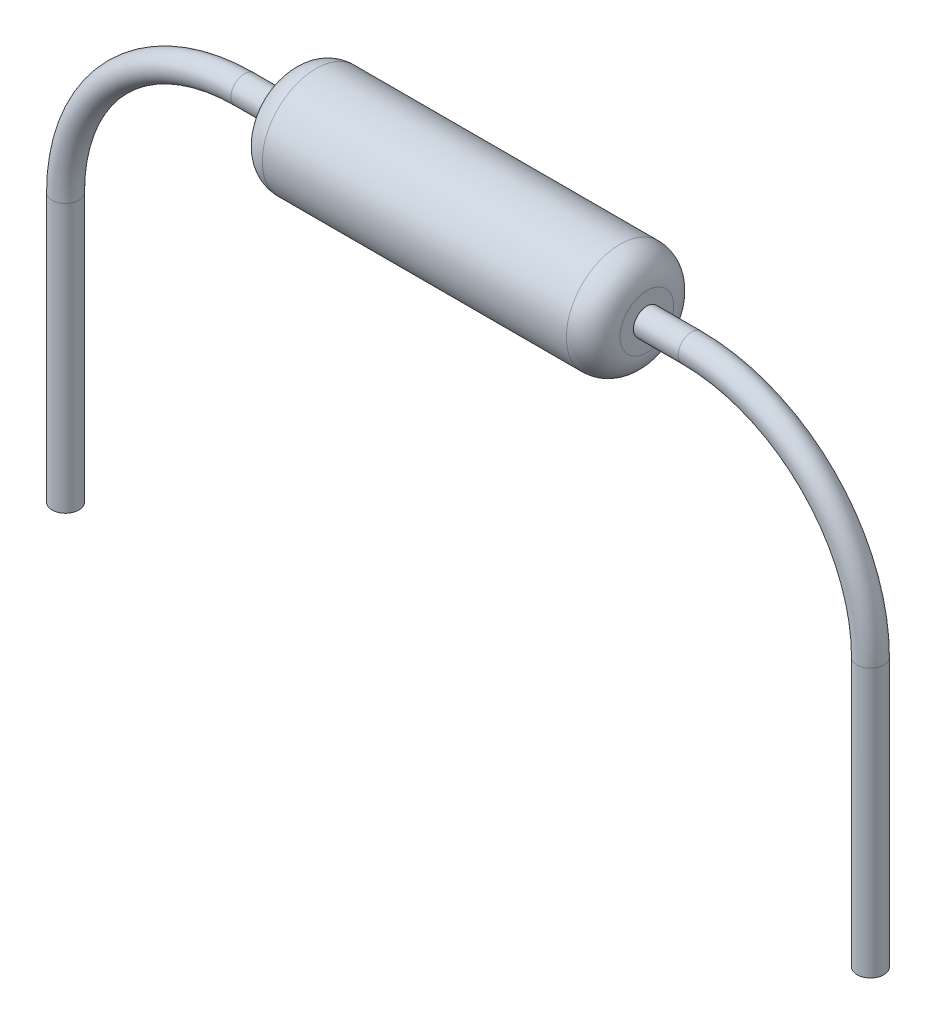
ISO-10303-21;
HEADER;
FILE_DESCRIPTION(('STEP AP214'),'2;1');
FILE_NAME('part.step','',(''),(''),'','','');
FILE_SCHEMA(('AUTOMOTIVE_DESIGN { 1 0 10303 214 1 1 1 1 }'));
ENDSEC;
DATA;
#1=APPLICATION_CONTEXT('core data for automotive mechanical design processes');
#2=APPLICATION_PROTOCOL_DEFINITION('international standard','automotive_design',2000,#1);
#3=PRODUCT_CONTEXT('',#1,'mechanical');
#4=PRODUCT('Part','Part','',(#3));
#5=PRODUCT_RELATED_PRODUCT_CATEGORY('part','',(#4));
#6=PRODUCT_DEFINITION_FORMATION('','',#4);
#7=PRODUCT_DEFINITION_CONTEXT('part definition',#1,'design');
#8=PRODUCT_DEFINITION('design','',#6,#7);
#9=PRODUCT_DEFINITION_SHAPE('','',#8);
#10=(LENGTH_UNIT() NAMED_UNIT(*) SI_UNIT(.MILLI.,.METRE.));
#11=(NAMED_UNIT(*) PLANE_ANGLE_UNIT() SI_UNIT($,.RADIAN.));
#12=(NAMED_UNIT(*) SI_UNIT($,.STERADIAN.) SOLID_ANGLE_UNIT());
#13=UNCERTAINTY_MEASURE_WITH_UNIT(LENGTH_MEASURE(1.E-05),#10,'distance_accuracy_value','');
#14=(GEOMETRIC_REPRESENTATION_CONTEXT(3) GLOBAL_UNCERTAINTY_ASSIGNED_CONTEXT((#13)) GLOBAL_UNIT_ASSIGNED_CONTEXT((#10,
#11,#12)) REPRESENTATION_CONTEXT('',''));
#15=CARTESIAN_POINT('',(0.,0.,0.));
#16=DIRECTION('',(0.,0.,1.));
#17=DIRECTION('',(1.,0.,0.));
#18=AXIS2_PLACEMENT_3D('',#15,#16,#17);
#19=CARTESIAN_POINT('',(-2.,0.3,0.));
#20=DIRECTION('',(-1.,0.,0.));
#21=DIRECTION('',(0.,-1.,0.));
#22=AXIS2_PLACEMENT_3D('',#19,#20,#21);
#23=PLANE('',#22);
#24=CARTESIAN_POINT('',(-2.,0.,0.));
#25=DIRECTION('',(1.,0.,0.));
#26=DIRECTION('',(0.,1.,0.));
#27=AXIS2_PLACEMENT_3D('',#24,#25,#26);
#28=CIRCLE('',#27,0.3);
#29=CARTESIAN_POINT('',(-2.,0.3,0.));
#30=VERTEX_POINT('',#29);
#31=EDGE_CURVE('E117',#30,#30,#28,.T.);
#32=ORIENTED_EDGE('',*,*,#31,.F.);
#33=EDGE_LOOP('',(#32));
#34=FACE_BOUND('',#33,.T.);
#35=CARTESIAN_POINT('',(-2.,0.,0.));
#36=DIRECTION('',(-1.,0.,0.));
#37=DIRECTION('',(0.,-1.,0.));
#38=AXIS2_PLACEMENT_3D('',#35,#36,#37);
#39=CIRCLE('',#38,0.15);
#40=CARTESIAN_POINT('',(-2.,-0.15,0.));
#41=VERTEX_POINT('',#40);
#42=EDGE_CURVE('E34',#41,#41,#39,.T.);
#43=ORIENTED_EDGE('',*,*,#42,.F.);
#44=EDGE_LOOP('',(#43));
#45=FACE_BOUND('',#44,.T.);
#46=ADVANCED_FACE('F30',(#34,#45),#23,.T.);
#47=CARTESIAN_POINT('',(2.,0.3,0.));
#48=DIRECTION('',(1.,0.,0.));
#49=DIRECTION('',(0.,1.,0.));
#50=AXIS2_PLACEMENT_3D('',#47,#48,#49);
#51=PLANE('',#50);
#52=CARTESIAN_POINT('',(2.,0.,0.));
#53=DIRECTION('',(1.,0.,0.));
#54=DIRECTION('',(0.,1.,0.));
#55=AXIS2_PLACEMENT_3D('',#52,#53,#54);
#56=CIRCLE('',#55,0.3);
#57=CARTESIAN_POINT('',(2.,0.3,0.));
#58=VERTEX_POINT('',#57);
#59=EDGE_CURVE('E134',#58,#58,#56,.T.);
#60=ORIENTED_EDGE('',*,*,#59,.T.);
#61=EDGE_LOOP('',(#60));
#62=FACE_BOUND('',#61,.T.);
#63=CARTESIAN_POINT('',(2.,0.,0.));
#64=DIRECTION('',(1.,0.,0.));
#65=DIRECTION('',(0.,1.,0.));
#66=AXIS2_PLACEMENT_3D('',#63,#64,#65);
#67=CIRCLE('',#66,0.15);
#68=CARTESIAN_POINT('',(2.,0.15,0.));
#69=VERTEX_POINT('',#68);
#70=EDGE_CURVE('E76',#69,#69,#67,.T.);
#71=ORIENTED_EDGE('',*,*,#70,.F.);
#72=EDGE_LOOP('',(#71));
#73=FACE_BOUND('',#72,.T.);
#74=ADVANCED_FACE('F148',(#62,#73),#51,.T.);
#75=CARTESIAN_POINT('',(-1.7,0.,0.));
#76=DIRECTION('',(1.,0.,0.));
#77=DIRECTION('',(0.,1.,0.));
#78=AXIS2_PLACEMENT_3D('',#75,#76,#77);
#79=TOROIDAL_SURFACE('',#78,0.3,0.3);
#80=ORIENTED_EDGE('',*,*,#31,.T.);
#81=EDGE_LOOP('',(#80));
#82=FACE_BOUND('',#81,.T.);
#83=CARTESIAN_POINT('',(-1.7,0.,0.));
#84=DIRECTION('',(1.,0.,0.));
#85=DIRECTION('',(0.,1.,0.));
#86=AXIS2_PLACEMENT_3D('',#83,#84,#85);
#87=CIRCLE('',#86,0.6);
#88=CARTESIAN_POINT('',(-1.7,0.6,0.));
#89=VERTEX_POINT('',#88);
#90=EDGE_CURVE('E77',#89,#89,#87,.T.);
#91=ORIENTED_EDGE('',*,*,#90,.F.);
#92=EDGE_LOOP('',(#91));
#93=FACE_BOUND('',#92,.T.);
#94=ADVANCED_FACE('F146',(#82,#93),#79,.T.);
#95=CARTESIAN_POINT('',(2.,0.,0.));
#96=DIRECTION('',(1.,0.,0.));
#97=DIRECTION('',(0.,1.,0.));
#98=AXIS2_PLACEMENT_3D('',#95,#96,#97);
#99=CYLINDRICAL_SURFACE('',#98,0.6);
#100=ORIENTED_EDGE('',*,*,#90,.T.);
#101=EDGE_LOOP('',(#100));
#102=FACE_BOUND('',#101,.T.);
#103=CARTESIAN_POINT('',(1.7,0.,0.));
#104=DIRECTION('',(1.,0.,0.));
#105=DIRECTION('',(0.,1.,0.));
#106=AXIS2_PLACEMENT_3D('',#103,#104,#105);
#107=CIRCLE('',#106,0.6);
#108=CARTESIAN_POINT('',(1.7,0.6,0.));
#109=VERTEX_POINT('',#108);
#110=EDGE_CURVE('E136',#109,#109,#107,.T.);
#111=ORIENTED_EDGE('',*,*,#110,.F.);
#112=EDGE_LOOP('',(#111));
#113=FACE_BOUND('',#112,.T.);
#114=ADVANCED_FACE('F143',(#102,#113),#99,.T.);
#115=CARTESIAN_POINT('',(1.7,0.,0.));
#116=DIRECTION('',(1.,0.,0.));
#117=DIRECTION('',(0.,1.,0.));
#118=AXIS2_PLACEMENT_3D('',#115,#116,#117);
#119=DEGENERATE_TOROIDAL_SURFACE('',#118,0.3,0.3,.T.);
#120=ORIENTED_EDGE('',*,*,#110,.T.);
#121=EDGE_LOOP('',(#120));
#122=FACE_BOUND('',#121,.T.);
#123=ORIENTED_EDGE('',*,*,#59,.F.);
#124=EDGE_LOOP('',(#123));
#125=FACE_BOUND('',#124,.T.);
#126=ADVANCED_FACE('F155',(#122,#125),#119,.T.);
#127=CARTESIAN_POINT('',(-4.5,-5.,0.));
#128=DIRECTION('',(0.,1.,0.));
#129=DIRECTION('',(0.,0.,1.));
#130=AXIS2_PLACEMENT_3D('',#127,#128,#129);
#131=CYLINDRICAL_SURFACE('',#130,0.15);
#132=CARTESIAN_POINT('',(-4.5,-5.,0.));
#133=DIRECTION('',(0.,1.,0.));
#134=DIRECTION('',(0.,0.,1.));
#135=AXIS2_PLACEMENT_3D('',#132,#133,#134);
#136=CIRCLE('',#135,0.15);
#137=CARTESIAN_POINT('',(-4.5,-5.,0.15));
#138=VERTEX_POINT('',#137);
#139=EDGE_CURVE('E114',#138,#138,#136,.T.);
#140=ORIENTED_EDGE('',*,*,#139,.T.);
#141=EDGE_LOOP('',(#140));
#142=FACE_BOUND('',#141,.T.);
#143=CARTESIAN_POINT('',(-4.5,-2.,0.));
#144=DIRECTION('',(0.,-1.,0.));
#145=DIRECTION('',(0.,0.,-1.));
#146=AXIS2_PLACEMENT_3D('',#143,#144,#145);
#147=CIRCLE('',#146,0.15);
#148=CARTESIAN_POINT('',(-4.65,-2.,0.));
#149=VERTEX_POINT('',#148);
#150=EDGE_CURVE('E84',#149,#149,#147,.T.);
#151=ORIENTED_EDGE('',*,*,#150,.T.);
#152=EDGE_LOOP('',(#151));
#153=FACE_BOUND('',#152,.T.);
#154=ADVANCED_FACE('F193',(#142,#153),#131,.T.);
#155=CARTESIAN_POINT('',(-2.5,-2.,0.));
#156=DIRECTION('',(0.,0.,-1.));
#157=DIRECTION('',(-1.,0.,0.));
#158=AXIS2_PLACEMENT_3D('',#155,#156,#157);
#159=TOROIDAL_SURFACE('',#158,2.,0.15);
#160=CARTESIAN_POINT('',(-2.5,0.,0.));
#161=DIRECTION('',(-1.,0.,0.));
#162=DIRECTION('',(0.,0.,-1.));
#163=AXIS2_PLACEMENT_3D('',#160,#161,#162);
#164=CIRCLE('',#163,0.15);
#165=CARTESIAN_POINT('',(-2.5,0.15,0.));
#166=VERTEX_POINT('',#165);
#167=EDGE_CURVE('E88',#166,#166,#164,.T.);
#168=CARTESIAN_POINT('',(-2.5,-2.,0.));
#169=DIRECTION('',(0.,0.,-1.));
#170=DIRECTION('',(-1.,0.,0.));
#171=AXIS2_PLACEMENT_3D('',#168,#169,#170);
#172=CIRCLE('',#171,2.15);
#173=EDGE_CURVE('',#149,#166,#172,.T.);
#174=ORIENTED_EDGE('',*,*,#150,.F.);
#175=ORIENTED_EDGE('',*,*,#167,.T.);
#176=ORIENTED_EDGE('',*,*,#173,.T.);
#177=ORIENTED_EDGE('',*,*,#173,.F.);
#178=EDGE_LOOP('',(#174,#176,#175,#177));
#179=FACE_BOUND('',#178,.T.);
#180=ADVANCED_FACE('F197',(#179),#159,.T.);
#181=CARTESIAN_POINT('',(-2.5,0.,0.));
#182=DIRECTION('',(1.,0.,0.));
#183=DIRECTION('',(0.,1.,0.));
#184=AXIS2_PLACEMENT_3D('',#181,#182,#183);
#185=CYLINDRICAL_SURFACE('',#184,0.15);
#186=ORIENTED_EDGE('',*,*,#42,.T.);
#187=EDGE_LOOP('',(#186));
#188=FACE_BOUND('',#187,.T.);
#189=ORIENTED_EDGE('',*,*,#167,.F.);
#190=EDGE_LOOP('',(#189));
#191=FACE_BOUND('',#190,.T.);
#192=ADVANCED_FACE('F108',(#188,#191),#185,.T.);
#193=CARTESIAN_POINT('',(4.5,-2.,0.));
#194=DIRECTION('',(0.,-1.,0.));
#195=DIRECTION('',(1.,0.,0.));
#196=AXIS2_PLACEMENT_3D('',#193,#194,#195);
#197=CYLINDRICAL_SURFACE('',#196,0.15);
#198=CARTESIAN_POINT('',(4.5,-2.,0.));
#199=DIRECTION('',(0.,1.,0.));
#200=DIRECTION('',(0.,0.,-1.));
#201=AXIS2_PLACEMENT_3D('',#198,#199,#200);
#202=CIRCLE('',#201,0.15);
#203=CARTESIAN_POINT('',(4.65,-2.,0.));
#204=VERTEX_POINT('',#203);
#205=EDGE_CURVE('E48',#204,#204,#202,.T.);
#206=ORIENTED_EDGE('',*,*,#205,.F.);
#207=EDGE_LOOP('',(#206));
#208=FACE_BOUND('',#207,.T.);
#209=CARTESIAN_POINT('',(4.5,-5.,0.));
#210=DIRECTION('',(0.,1.,0.));
#211=DIRECTION('',(0.,0.,1.));
#212=AXIS2_PLACEMENT_3D('',#209,#210,#211);
#213=CIRCLE('',#212,0.15);
#214=CARTESIAN_POINT('',(4.5,-5.,0.15));
#215=VERTEX_POINT('',#214);
#216=EDGE_CURVE('E112',#215,#215,#213,.T.);
#217=ORIENTED_EDGE('',*,*,#216,.T.);
#218=EDGE_LOOP('',(#217));
#219=FACE_BOUND('',#218,.T.);
#220=ADVANCED_FACE('F105',(#208,#219),#197,.T.);
#221=CARTESIAN_POINT('',(2.5,-2.,0.));
#222=DIRECTION('',(0.,0.,-1.));
#223=DIRECTION('',(-1.,0.,0.));
#224=AXIS2_PLACEMENT_3D('',#221,#222,#223);
#225=TOROIDAL_SURFACE('',#224,2.,0.15);
#226=CARTESIAN_POINT('',(2.5,0.,0.));
#227=DIRECTION('',(-1.,0.,0.));
#228=DIRECTION('',(0.,0.,-1.));
#229=AXIS2_PLACEMENT_3D('',#226,#227,#228);
#230=CIRCLE('',#229,0.15);
#231=CARTESIAN_POINT('',(2.5,0.15,0.));
#232=VERTEX_POINT('',#231);
#233=EDGE_CURVE('E93',#232,#232,#230,.T.);
#234=CARTESIAN_POINT('',(2.5,-2.,0.));
#235=DIRECTION('',(0.,0.,-1.));
#236=DIRECTION('',(-1.,0.,0.));
#237=AXIS2_PLACEMENT_3D('',#234,#235,#236);
#238=CIRCLE('',#237,2.15);
#239=EDGE_CURVE('',#232,#204,#238,.T.);
#240=ORIENTED_EDGE('',*,*,#233,.F.);
#241=ORIENTED_EDGE('',*,*,#205,.T.);
#242=ORIENTED_EDGE('',*,*,#239,.T.);
#243=ORIENTED_EDGE('',*,*,#239,.F.);
#244=EDGE_LOOP('',(#240,#242,#241,#243));
#245=FACE_BOUND('',#244,.T.);
#246=ADVANCED_FACE('F103',(#245),#225,.T.);
#247=ORIENTED_EDGE('',*,*,#70,.T.);
#248=EDGE_LOOP('',(#247));
#249=FACE_BOUND('',#248,.T.);
#250=ORIENTED_EDGE('',*,*,#233,.T.);
#251=EDGE_LOOP('',(#250));
#252=FACE_BOUND('',#251,.T.);
#253=ADVANCED_FACE('F204',(#249,#252),#185,.T.);
#254=CARTESIAN_POINT('',(-5.,-5.,-0.6));
#255=DIRECTION('',(0.,1.,0.));
#256=DIRECTION('',(0.,0.,1.));
#257=AXIS2_PLACEMENT_3D('',#254,#255,#256);
#258=PLANE('',#257);
#259=ORIENTED_EDGE('',*,*,#216,.F.);
#260=EDGE_LOOP('',(#259));
#261=FACE_BOUND('',#260,.T.);
#262=ADVANCED_FACE('F206',(#261),#258,.F.);
#263=ORIENTED_EDGE('',*,*,#139,.F.);
#264=EDGE_LOOP('',(#263));
#265=FACE_BOUND('',#264,.T.);
#266=ADVANCED_FACE('F169',(#265),#258,.F.);
#267=CLOSED_SHELL('',(#46,#74,#94,#114,#126,#154,#180,#192,#220,#246,#253,#262,#266));
#268=CARTESIAN_POINT('',(-1.75,0.35,0.));
#269=DIRECTION('',(1.,0.,0.));
#270=DIRECTION('',(0.,0.,-1.));
#271=AXIS2_PLACEMENT_3D('',#268,#269,#270);
#272=PLANE('',#271);
#273=CARTESIAN_POINT('',(-1.75,0.,0.));
#274=DIRECTION('',(1.,0.,0.));
#275=DIRECTION('',(0.,0.,-1.));
#276=AXIS2_PLACEMENT_3D('',#273,#274,#275);
#277=CIRCLE('',#276,0.25);
#278=CARTESIAN_POINT('',(-1.75,0.,-0.25));
#279=VERTEX_POINT('',#278);
#280=EDGE_CURVE('E56',#279,#279,#277,.F.);
#281=ORIENTED_EDGE('',*,*,#280,.T.);
#282=EDGE_LOOP('',(#281));
#283=FACE_BOUND('',#282,.T.);
#284=CARTESIAN_POINT('',(-1.75,0.,0.));
#285=DIRECTION('',(1.,0.,0.));
#286=DIRECTION('',(0.,0.,-1.));
#287=AXIS2_PLACEMENT_3D('',#284,#285,#286);
#288=CIRCLE('',#287,0.15);
#289=CARTESIAN_POINT('',(-1.75,0.,-0.15));
#290=VERTEX_POINT('',#289);
#291=EDGE_CURVE('E10',#290,#290,#288,.F.);
#292=ORIENTED_EDGE('',*,*,#291,.F.);
#293=EDGE_LOOP('',(#292));
#294=FACE_BOUND('',#293,.T.);
#295=ADVANCED_FACE('F232',(#283,#294),#272,.F.);
#296=CARTESIAN_POINT('',(1.75,0.35,0.));
#297=DIRECTION('',(-1.,0.,0.));
#298=DIRECTION('',(0.,0.,1.));
#299=AXIS2_PLACEMENT_3D('',#296,#297,#298);
#300=PLANE('',#299);
#301=CARTESIAN_POINT('',(1.75,0.,0.));
#302=DIRECTION('',(-1.,0.,0.));
#303=DIRECTION('',(0.,0.,1.));
#304=AXIS2_PLACEMENT_3D('',#301,#302,#303);
#305=CIRCLE('',#304,0.25);
#306=CARTESIAN_POINT('',(1.75,0.,0.25));
#307=VERTEX_POINT('',#306);
#308=EDGE_CURVE('E65',#307,#307,#305,.F.);
#309=ORIENTED_EDGE('',*,*,#308,.T.);
#310=EDGE_LOOP('',(#309));
#311=FACE_BOUND('',#310,.T.);
#312=CARTESIAN_POINT('',(1.75,0.,0.));
#313=DIRECTION('',(-1.,0.,0.));
#314=DIRECTION('',(0.,0.,1.));
#315=AXIS2_PLACEMENT_3D('',#312,#313,#314);
#316=CIRCLE('',#315,0.15);
#317=CARTESIAN_POINT('',(1.75,0.,0.15));
#318=VERTEX_POINT('',#317);
#319=EDGE_CURVE('E39',#318,#318,#316,.F.);
#320=ORIENTED_EDGE('',*,*,#319,.F.);
#321=EDGE_LOOP('',(#320));
#322=FACE_BOUND('',#321,.T.);
#323=ADVANCED_FACE('F234',(#311,#322),#300,.F.);
#324=CARTESIAN_POINT('',(-19.9518482490272,0.,0.));
#325=DIRECTION('',(-1.,0.,0.));
#326=DIRECTION('',(0.,0.,1.));
#327=AXIS2_PLACEMENT_3D('',#324,#325,#326);
#328=CYLINDRICAL_SURFACE('',#327,0.35);
#329=CARTESIAN_POINT('',(-1.65,0.,0.));
#330=DIRECTION('',(1.,0.,0.));
#331=DIRECTION('',(0.,0.,-1.));
#332=AXIS2_PLACEMENT_3D('',#329,#330,#331);
#333=CIRCLE('',#332,0.35);
#334=CARTESIAN_POINT('',(-1.65,0.,-0.35));
#335=VERTEX_POINT('',#334);
#336=EDGE_CURVE('E62',#335,#335,#333,.T.);
#337=ORIENTED_EDGE('',*,*,#336,.T.);
#338=EDGE_LOOP('',(#337));
#339=FACE_BOUND('',#338,.T.);
#340=CARTESIAN_POINT('',(0.150000000000001,0.,0.));
#341=DIRECTION('',(1.,0.,0.));
#342=DIRECTION('',(0.,0.,-1.));
#343=AXIS2_PLACEMENT_3D('',#340,#341,#342);
#344=CIRCLE('',#343,0.35);
#345=CARTESIAN_POINT('',(0.150000000000001,0.,-0.35));
#346=VERTEX_POINT('',#345);
#347=EDGE_CURVE('E44',#346,#346,#344,.T.);
#348=ORIENTED_EDGE('',*,*,#347,.F.);
#349=EDGE_LOOP('',(#348));
#350=FACE_BOUND('',#349,.T.);
#351=ADVANCED_FACE('F231',(#339,#350),#328,.T.);
#352=CARTESIAN_POINT('',(-1.65,0.,0.));
#353=DIRECTION('',(1.,0.,0.));
#354=DIRECTION('',(0.,0.,-1.));
#355=AXIS2_PLACEMENT_3D('',#352,#353,#354);
#356=TOROIDAL_SURFACE('',#355,0.25,0.1);
#357=ORIENTED_EDGE('',*,*,#336,.F.);
#358=EDGE_LOOP('',(#357));
#359=FACE_BOUND('',#358,.T.);
#360=ORIENTED_EDGE('',*,*,#280,.F.);
#361=EDGE_LOOP('',(#360));
#362=FACE_BOUND('',#361,.T.);
#363=ADVANCED_FACE('F244',(#359,#362),#356,.T.);
#364=CARTESIAN_POINT('',(0.150000000000001,0.,0.));
#365=DIRECTION('',(1.,0.,0.));
#366=DIRECTION('',(0.,0.,-1.));
#367=AXIS2_PLACEMENT_3D('',#364,#365,#366);
#368=PLANE('',#367);
#369=CARTESIAN_POINT('',(0.15,0.,0.));
#370=DIRECTION('',(-1.,0.,0.));
#371=DIRECTION('',(0.,0.,1.));
#372=AXIS2_PLACEMENT_3D('',#369,#370,#371);
#373=CIRCLE('',#372,0.55);
#374=CARTESIAN_POINT('',(0.15,0.,0.55));
#375=VERTEX_POINT('',#374);
#376=EDGE_CURVE('E53',#375,#375,#373,.T.);
#377=ORIENTED_EDGE('',*,*,#376,.T.);
#378=EDGE_LOOP('',(#377));
#379=FACE_BOUND('',#378,.T.);
#380=ORIENTED_EDGE('',*,*,#347,.T.);
#381=EDGE_LOOP('',(#380));
#382=FACE_BOUND('',#381,.T.);
#383=ADVANCED_FACE('F246',(#379,#382),#368,.F.);
#384=CARTESIAN_POINT('',(1.25,0.55,0.));
#385=DIRECTION('',(-1.,0.,0.));
#386=DIRECTION('',(0.,0.,1.));
#387=AXIS2_PLACEMENT_3D('',#384,#385,#386);
#388=PLANE('',#387);
#389=CARTESIAN_POINT('',(1.25,0.,0.));
#390=DIRECTION('',(-1.,0.,0.));
#391=DIRECTION('',(0.,0.,1.));
#392=AXIS2_PLACEMENT_3D('',#389,#390,#391);
#393=CIRCLE('',#392,0.55);
#394=CARTESIAN_POINT('',(1.25,0.,0.55));
#395=VERTEX_POINT('',#394);
#396=EDGE_CURVE('E50',#395,#395,#393,.T.);
#397=ORIENTED_EDGE('',*,*,#396,.F.);
#398=EDGE_LOOP('',(#397));
#399=FACE_BOUND('',#398,.T.);
#400=CARTESIAN_POINT('',(1.25,0.,0.));
#401=DIRECTION('',(-1.,0.,0.));
#402=DIRECTION('',(0.,0.,1.));
#403=AXIS2_PLACEMENT_3D('',#400,#401,#402);
#404=CIRCLE('',#403,0.35);
#405=CARTESIAN_POINT('',(1.25,0.,0.35));
#406=VERTEX_POINT('',#405);
#407=EDGE_CURVE('E68',#406,#406,#404,.T.);
#408=ORIENTED_EDGE('',*,*,#407,.T.);
#409=EDGE_LOOP('',(#408));
#410=FACE_BOUND('',#409,.T.);
#411=ADVANCED_FACE('F252',(#399,#410),#388,.F.);
#412=CARTESIAN_POINT('',(0.,0.,0.));
#413=DIRECTION('',(-1.,0.,0.));
#414=DIRECTION('',(0.,0.,1.));
#415=AXIS2_PLACEMENT_3D('',#412,#413,#414);
#416=CYLINDRICAL_SURFACE('',#415,0.55);
#417=ORIENTED_EDGE('',*,*,#376,.F.);
#418=EDGE_LOOP('',(#417));
#419=FACE_BOUND('',#418,.T.);
#420=ORIENTED_EDGE('',*,*,#396,.T.);
#421=EDGE_LOOP('',(#420));
#422=FACE_BOUND('',#421,.T.);
#423=ADVANCED_FACE('F398',(#419,#422),#416,.T.);
#424=CARTESIAN_POINT('',(1.65,0.,0.));
#425=DIRECTION('',(-1.,0.,0.));
#426=DIRECTION('',(0.,0.,1.));
#427=AXIS2_PLACEMENT_3D('',#424,#425,#426);
#428=TOROIDAL_SURFACE('',#427,0.25,0.1);
#429=ORIENTED_EDGE('',*,*,#308,.F.);
#430=EDGE_LOOP('',(#429));
#431=FACE_BOUND('',#430,.T.);
#432=CARTESIAN_POINT('',(1.65,0.,0.));
#433=DIRECTION('',(-1.,0.,0.));
#434=DIRECTION('',(0.,0.,1.));
#435=AXIS2_PLACEMENT_3D('',#432,#433,#434);
#436=CIRCLE('',#435,0.35);
#437=CARTESIAN_POINT('',(1.65,0.,0.35));
#438=VERTEX_POINT('',#437);
#439=EDGE_CURVE('E59',#438,#438,#436,.T.);
#440=ORIENTED_EDGE('',*,*,#439,.F.);
#441=EDGE_LOOP('',(#440));
#442=FACE_BOUND('',#441,.T.);
#443=ADVANCED_FACE('F32',(#431,#442),#428,.T.);
#444=ORIENTED_EDGE('',*,*,#439,.T.);
#445=EDGE_LOOP('',(#444));
#446=FACE_BOUND('',#445,.T.);
#447=ORIENTED_EDGE('',*,*,#407,.F.);
#448=EDGE_LOOP('',(#447));
#449=FACE_BOUND('',#448,.T.);
#450=ADVANCED_FACE('F225',(#446,#449),#328,.T.);
#451=CARTESIAN_POINT('',(-1.955,0.,0.));
#452=DIRECTION('',(1.,0.,0.));
#453=DIRECTION('',(0.,1.,0.));
#454=AXIS2_PLACEMENT_3D('',#451,#452,#453);
#455=CIRCLE('',#454,0.15);
#456=CARTESIAN_POINT('',(-1.955,0.15,0.));
#457=VERTEX_POINT('',#456);
#458=EDGE_CURVE('E79',#457,#457,#455,.T.);
#459=ORIENTED_EDGE('',*,*,#458,.T.);
#460=EDGE_LOOP('',(#459));
#461=FACE_BOUND('',#460,.T.);
#462=ORIENTED_EDGE('',*,*,#291,.T.);
#463=EDGE_LOOP('',(#462));
#464=FACE_BOUND('',#463,.T.);
#465=ADVANCED_FACE('F214',(#461,#464),#185,.T.);
#466=CARTESIAN_POINT('',(1.955,0.,0.));
#467=DIRECTION('',(-1.,0.,0.));
#468=DIRECTION('',(0.,-1.,0.));
#469=AXIS2_PLACEMENT_3D('',#466,#467,#468);
#470=CIRCLE('',#469,0.15);
#471=CARTESIAN_POINT('',(1.955,-0.15,0.));
#472=VERTEX_POINT('',#471);
#473=EDGE_CURVE('E73',#472,#472,#470,.T.);
#474=ORIENTED_EDGE('',*,*,#473,.T.);
#475=EDGE_LOOP('',(#474));
#476=FACE_BOUND('',#475,.T.);
#477=ORIENTED_EDGE('',*,*,#319,.T.);
#478=EDGE_LOOP('',(#477));
#479=FACE_BOUND('',#478,.T.);
#480=ADVANCED_FACE('F174',(#476,#479),#185,.T.);
#481=CARTESIAN_POINT('',(-1.955,0.3,0.));
#482=DIRECTION('',(1.,0.,0.));
#483=DIRECTION('',(0.,1.,0.));
#484=AXIS2_PLACEMENT_3D('',#481,#482,#483);
#485=PLANE('',#484);
#486=CARTESIAN_POINT('',(-1.955,0.,0.));
#487=DIRECTION('',(1.,0.,0.));
#488=DIRECTION('',(0.,1.,0.));
#489=AXIS2_PLACEMENT_3D('',#486,#487,#488);
#490=CIRCLE('',#489,0.3);
#491=CARTESIAN_POINT('',(-1.955,0.3,0.));
#492=VERTEX_POINT('',#491);
#493=EDGE_CURVE('E122',#492,#492,#490,.T.);
#494=ORIENTED_EDGE('',*,*,#493,.T.);
#495=EDGE_LOOP('',(#494));
#496=FACE_BOUND('',#495,.T.);
#497=ORIENTED_EDGE('',*,*,#458,.F.);
#498=EDGE_LOOP('',(#497));
#499=FACE_BOUND('',#498,.T.);
#500=ADVANCED_FACE('F170',(#496,#499),#485,.T.);
#501=CARTESIAN_POINT('',(1.955,0.3,0.));
#502=DIRECTION('',(-1.,0.,0.));
#503=DIRECTION('',(0.,-1.,0.));
#504=AXIS2_PLACEMENT_3D('',#501,#502,#503);
#505=PLANE('',#504);
#506=CARTESIAN_POINT('',(1.955,0.,0.));
#507=DIRECTION('',(1.,0.,0.));
#508=DIRECTION('',(0.,1.,0.));
#509=AXIS2_PLACEMENT_3D('',#506,#507,#508);
#510=CIRCLE('',#509,0.3);
#511=CARTESIAN_POINT('',(1.955,0.3,0.));
#512=VERTEX_POINT('',#511);
#513=EDGE_CURVE('E131',#512,#512,#510,.T.);
#514=ORIENTED_EDGE('',*,*,#513,.F.);
#515=EDGE_LOOP('',(#514));
#516=FACE_BOUND('',#515,.T.);
#517=ORIENTED_EDGE('',*,*,#473,.F.);
#518=EDGE_LOOP('',(#517));
#519=FACE_BOUND('',#518,.T.);
#520=ADVANCED_FACE('F173',(#516,#519),#505,.T.);
#521=CARTESIAN_POINT('',(1.7,0.,0.));
#522=DIRECTION('',(1.,0.,0.));
#523=DIRECTION('',(0.,1.,0.));
#524=AXIS2_PLACEMENT_3D('',#521,#522,#523);
#525=TOROIDAL_SURFACE('',#524,0.3,0.255);
#526=ORIENTED_EDGE('',*,*,#513,.T.);
#527=EDGE_LOOP('',(#526));
#528=FACE_BOUND('',#527,.T.);
#529=CARTESIAN_POINT('',(1.7,0.,0.));
#530=DIRECTION('',(1.,0.,0.));
#531=DIRECTION('',(0.,1.,0.));
#532=AXIS2_PLACEMENT_3D('',#529,#530,#531);
#533=CIRCLE('',#532,0.555);
#534=CARTESIAN_POINT('',(1.7,0.555,0.));
#535=VERTEX_POINT('',#534);
#536=EDGE_CURVE('E128',#535,#535,#533,.T.);
#537=ORIENTED_EDGE('',*,*,#536,.F.);
#538=EDGE_LOOP('',(#537));
#539=FACE_BOUND('',#538,.T.);
#540=ADVANCED_FACE('F184',(#528,#539),#525,.F.);
#541=CARTESIAN_POINT('',(2.,0.,0.));
#542=DIRECTION('',(1.,0.,0.));
#543=DIRECTION('',(0.,1.,0.));
#544=AXIS2_PLACEMENT_3D('',#541,#542,#543);
#545=CYLINDRICAL_SURFACE('',#544,0.555);
#546=ORIENTED_EDGE('',*,*,#536,.T.);
#547=EDGE_LOOP('',(#546));
#548=FACE_BOUND('',#547,.T.);
#549=CARTESIAN_POINT('',(-1.7,0.,0.));
#550=DIRECTION('',(1.,0.,0.));
#551=DIRECTION('',(0.,1.,0.));
#552=AXIS2_PLACEMENT_3D('',#549,#550,#551);
#553=CIRCLE('',#552,0.555);
#554=CARTESIAN_POINT('',(-1.7,0.555,0.));
#555=VERTEX_POINT('',#554);
#556=EDGE_CURVE('E125',#555,#555,#553,.T.);
#557=ORIENTED_EDGE('',*,*,#556,.F.);
#558=EDGE_LOOP('',(#557));
#559=FACE_BOUND('',#558,.T.);
#560=ADVANCED_FACE('F180',(#548,#559),#545,.F.);
#561=CARTESIAN_POINT('',(-1.7,0.,0.));
#562=DIRECTION('',(1.,0.,0.));
#563=DIRECTION('',(0.,1.,0.));
#564=AXIS2_PLACEMENT_3D('',#561,#562,#563);
#565=TOROIDAL_SURFACE('',#564,0.3,0.255);
#566=ORIENTED_EDGE('',*,*,#556,.T.);
#567=EDGE_LOOP('',(#566));
#568=FACE_BOUND('',#567,.T.);
#569=ORIENTED_EDGE('',*,*,#493,.F.);
#570=EDGE_LOOP('',(#569));
#571=FACE_BOUND('',#570,.T.);
#572=ADVANCED_FACE('F177',(#568,#571),#565,.F.);
#573=CLOSED_SHELL('',(#295,#323,#351,#363,#383,#411,#423,#443,#450,#465,#480,#500,#520,#540,
#560,#572));
#574=ORIENTED_CLOSED_SHELL('',*,#573,.T.);
#575=BREP_WITH_VOIDS('B2',#267,(#574));
#576=ADVANCED_BREP_SHAPE_REPRESENTATION('',(#18,#575),#14);
#577=SHAPE_DEFINITION_REPRESENTATION(#9,#576);
ENDSEC;
END-ISO-10303-21;
